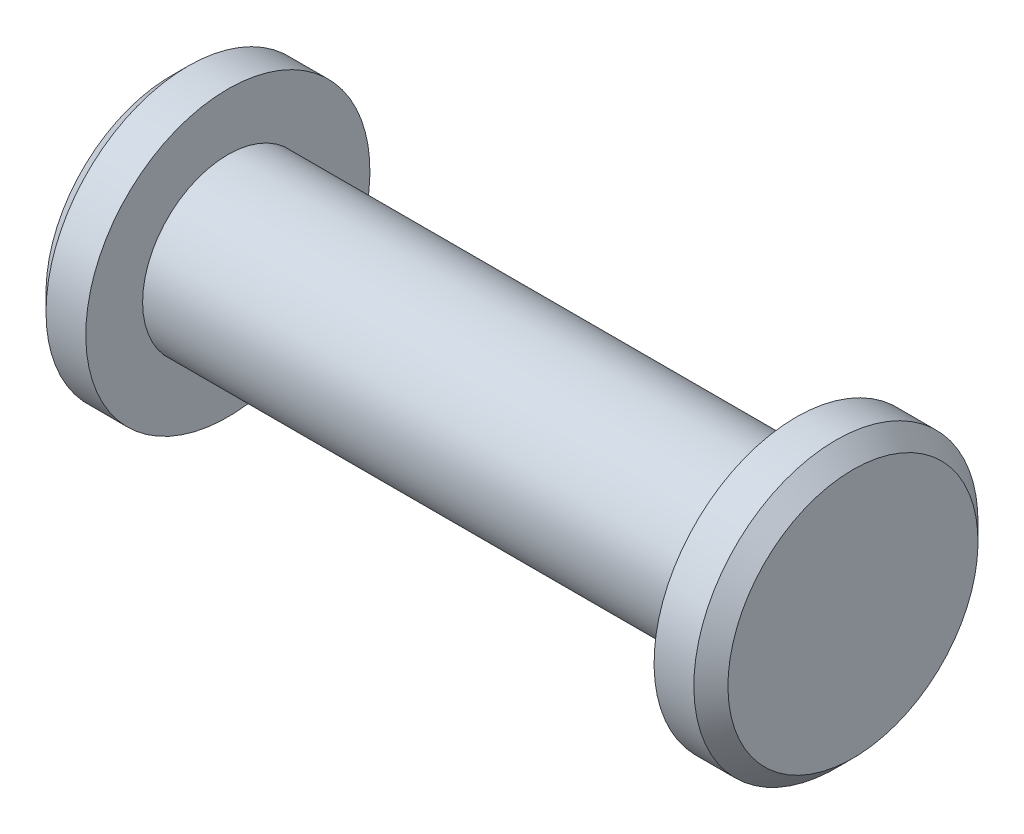
ISO-10303-21;
HEADER;
FILE_DESCRIPTION(('STEP AP214'),'2;1');
FILE_NAME('part.step','',(''),(''),'','','');
FILE_SCHEMA(('AUTOMOTIVE_DESIGN { 1 0 10303 214 1 1 1 1 }'));
ENDSEC;
DATA;
#1=APPLICATION_CONTEXT('core data for automotive mechanical design processes');
#2=APPLICATION_PROTOCOL_DEFINITION('international standard','automotive_design',2000,#1);
#3=PRODUCT_CONTEXT('',#1,'mechanical');
#4=PRODUCT('Part','Part','',(#3));
#5=PRODUCT_RELATED_PRODUCT_CATEGORY('part','',(#4));
#6=PRODUCT_DEFINITION_FORMATION('','',#4);
#7=PRODUCT_DEFINITION_CONTEXT('part definition',#1,'design');
#8=PRODUCT_DEFINITION('design','',#6,#7);
#9=PRODUCT_DEFINITION_SHAPE('','',#8);
#10=(LENGTH_UNIT() NAMED_UNIT(*) SI_UNIT(.MILLI.,.METRE.));
#11=(NAMED_UNIT(*) PLANE_ANGLE_UNIT() SI_UNIT($,.RADIAN.));
#12=(NAMED_UNIT(*) SI_UNIT($,.STERADIAN.) SOLID_ANGLE_UNIT());
#13=UNCERTAINTY_MEASURE_WITH_UNIT(LENGTH_MEASURE(1.E-05),#10,'distance_accuracy_value','');
#14=(GEOMETRIC_REPRESENTATION_CONTEXT(3) GLOBAL_UNCERTAINTY_ASSIGNED_CONTEXT((#13)) GLOBAL_UNIT_ASSIGNED_CONTEXT((#10,
#11,#12)) REPRESENTATION_CONTEXT('',''));
#15=CARTESIAN_POINT('',(0.,0.,0.));
#16=DIRECTION('',(0.,0.,1.));
#17=DIRECTION('',(1.,0.,0.));
#18=AXIS2_PLACEMENT_3D('',#15,#16,#17);
#19=CARTESIAN_POINT('',(0.,25.,0.));
#20=DIRECTION('',(1.,0.,0.));
#21=DIRECTION('',(0.,1.,0.));
#22=AXIS2_PLACEMENT_3D('',#19,#20,#21);
#23=PLANE('',#22);
#24=CARTESIAN_POINT('',(0.,0.,0.));
#25=DIRECTION('',(1.,0.,0.));
#26=DIRECTION('',(0.,1.,0.));
#27=AXIS2_PLACEMENT_3D('',#24,#25,#26);
#28=CIRCLE('',#27,22.0000000000001);
#29=CARTESIAN_POINT('',(0.,22.0000000000001,0.));
#30=VERTEX_POINT('',#29);
#31=EDGE_CURVE('E41',#30,#30,#28,.T.);
#32=ORIENTED_EDGE('',*,*,#31,.T.);
#33=EDGE_LOOP('',(#32));
#34=FACE_BOUND('',#33,.T.);
#35=ADVANCED_FACE('F33',(#34),#23,.T.);
#36=CARTESIAN_POINT('',(-120.,0.,0.));
#37=DIRECTION('',(-1.,0.,0.));
#38=DIRECTION('',(0.,-1.,0.));
#39=AXIS2_PLACEMENT_3D('',#36,#37,#38);
#40=PLANE('',#39);
#41=CARTESIAN_POINT('',(-120.,0.,0.));
#42=DIRECTION('',(-1.,0.,0.));
#43=DIRECTION('',(0.,-1.,0.));
#44=AXIS2_PLACEMENT_3D('',#41,#42,#43);
#45=CIRCLE('',#44,22.);
#46=CARTESIAN_POINT('',(-120.,-22.,0.));
#47=VERTEX_POINT('',#46);
#48=EDGE_CURVE('E45',#47,#47,#45,.T.);
#49=ORIENTED_EDGE('',*,*,#48,.T.);
#50=EDGE_LOOP('',(#49));
#51=FACE_BOUND('',#50,.T.);
#52=ADVANCED_FACE('F84',(#51),#40,.T.);
#53=CARTESIAN_POINT('',(0.,0.,0.));
#54=DIRECTION('',(1.,0.,0.));
#55=DIRECTION('',(0.,1.,0.));
#56=AXIS2_PLACEMENT_3D('',#53,#54,#55);
#57=CYLINDRICAL_SURFACE('',#56,25.);
#58=CARTESIAN_POINT('',(-117.,0.,0.));
#59=DIRECTION('',(-1.,0.,0.));
#60=DIRECTION('',(0.,-1.,0.));
#61=AXIS2_PLACEMENT_3D('',#58,#59,#60);
#62=CIRCLE('',#61,25.);
#63=CARTESIAN_POINT('',(-117.,-25.,0.));
#64=VERTEX_POINT('',#63);
#65=EDGE_CURVE('E49',#64,#64,#62,.F.);
#66=ORIENTED_EDGE('',*,*,#65,.T.);
#67=EDGE_LOOP('',(#66));
#68=FACE_BOUND('',#67,.T.);
#69=CARTESIAN_POINT('',(-110.,0.,0.));
#70=DIRECTION('',(1.,0.,0.));
#71=DIRECTION('',(0.,1.,0.));
#72=AXIS2_PLACEMENT_3D('',#69,#70,#71);
#73=CIRCLE('',#72,25.);
#74=CARTESIAN_POINT('',(-110.,25.,0.));
#75=VERTEX_POINT('',#74);
#76=EDGE_CURVE('E54',#75,#75,#73,.T.);
#77=ORIENTED_EDGE('',*,*,#76,.F.);
#78=EDGE_LOOP('',(#77));
#79=FACE_BOUND('',#78,.T.);
#80=ADVANCED_FACE('F89',(#68,#79),#57,.T.);
#81=CARTESIAN_POINT('',(-110.,25.,0.));
#82=DIRECTION('',(1.,0.,0.));
#83=DIRECTION('',(0.,1.,0.));
#84=AXIS2_PLACEMENT_3D('',#81,#82,#83);
#85=PLANE('',#84);
#86=ORIENTED_EDGE('',*,*,#76,.T.);
#87=EDGE_LOOP('',(#86));
#88=FACE_BOUND('',#87,.T.);
#89=CARTESIAN_POINT('',(-110.,0.,0.));
#90=DIRECTION('',(1.,0.,0.));
#91=DIRECTION('',(0.,1.,0.));
#92=AXIS2_PLACEMENT_3D('',#89,#90,#91);
#93=CIRCLE('',#92,15.);
#94=CARTESIAN_POINT('',(-110.,15.,0.));
#95=VERTEX_POINT('',#94);
#96=EDGE_CURVE('E57',#95,#95,#93,.T.);
#97=ORIENTED_EDGE('',*,*,#96,.F.);
#98=EDGE_LOOP('',(#97));
#99=FACE_BOUND('',#98,.T.);
#100=ADVANCED_FACE('F80',(#88,#99),#85,.T.);
#101=CARTESIAN_POINT('',(0.,0.,0.));
#102=DIRECTION('',(1.,0.,0.));
#103=DIRECTION('',(0.,1.,0.));
#104=AXIS2_PLACEMENT_3D('',#101,#102,#103);
#105=CYLINDRICAL_SURFACE('',#104,15.);
#106=ORIENTED_EDGE('',*,*,#96,.T.);
#107=EDGE_LOOP('',(#106));
#108=FACE_BOUND('',#107,.T.);
#109=CARTESIAN_POINT('',(-10.,0.,0.));
#110=DIRECTION('',(1.,0.,0.));
#111=DIRECTION('',(0.,1.,0.));
#112=AXIS2_PLACEMENT_3D('',#109,#110,#111);
#113=CIRCLE('',#112,15.);
#114=CARTESIAN_POINT('',(-10.,15.,0.));
#115=VERTEX_POINT('',#114);
#116=EDGE_CURVE('E60',#115,#115,#113,.T.);
#117=ORIENTED_EDGE('',*,*,#116,.F.);
#118=EDGE_LOOP('',(#117));
#119=FACE_BOUND('',#118,.T.);
#120=ADVANCED_FACE('F71',(#108,#119),#105,.T.);
#121=CARTESIAN_POINT('',(-10.,15.,0.));
#122=DIRECTION('',(-1.,0.,0.));
#123=DIRECTION('',(0.,-1.,0.));
#124=AXIS2_PLACEMENT_3D('',#121,#122,#123);
#125=PLANE('',#124);
#126=ORIENTED_EDGE('',*,*,#116,.T.);
#127=EDGE_LOOP('',(#126));
#128=FACE_BOUND('',#127,.T.);
#129=CARTESIAN_POINT('',(-9.99999999999999,0.,0.));
#130=DIRECTION('',(1.,0.,0.));
#131=DIRECTION('',(0.,1.,0.));
#132=AXIS2_PLACEMENT_3D('',#129,#130,#131);
#133=CIRCLE('',#132,25.);
#134=CARTESIAN_POINT('',(-10.,25.,0.));
#135=VERTEX_POINT('',#134);
#136=EDGE_CURVE('E63',#135,#135,#133,.T.);
#137=ORIENTED_EDGE('',*,*,#136,.F.);
#138=EDGE_LOOP('',(#137));
#139=FACE_BOUND('',#138,.T.);
#140=ADVANCED_FACE('F69',(#128,#139),#125,.T.);
#141=CARTESIAN_POINT('',(0.,0.,0.));
#142=DIRECTION('',(1.,0.,0.));
#143=DIRECTION('',(0.,1.,0.));
#144=AXIS2_PLACEMENT_3D('',#141,#142,#143);
#145=CYLINDRICAL_SURFACE('',#144,25.);
#146=CARTESIAN_POINT('',(-2.99999999999995,0.,0.));
#147=DIRECTION('',(1.,0.,0.));
#148=DIRECTION('',(0.,1.,0.));
#149=AXIS2_PLACEMENT_3D('',#146,#147,#148);
#150=CIRCLE('',#149,25.);
#151=CARTESIAN_POINT('',(-2.99999999999995,25.,0.));
#152=VERTEX_POINT('',#151);
#153=EDGE_CURVE('E10',#152,#152,#150,.F.);
#154=ORIENTED_EDGE('',*,*,#153,.T.);
#155=EDGE_LOOP('',(#154));
#156=FACE_BOUND('',#155,.T.);
#157=ORIENTED_EDGE('',*,*,#136,.T.);
#158=EDGE_LOOP('',(#157));
#159=FACE_BOUND('',#158,.T.);
#160=ADVANCED_FACE('F67',(#156,#159),#145,.T.);
#161=CARTESIAN_POINT('',(-117.,0.,0.));
#162=DIRECTION('',(1.,0.,0.));
#163=DIRECTION('',(0.,1.,0.));
#164=AXIS2_PLACEMENT_3D('',#161,#162,#163);
#165=CONICAL_SURFACE('',#164,25.,0.78539816339745);
#166=ORIENTED_EDGE('',*,*,#48,.F.);
#167=EDGE_LOOP('',(#166));
#168=FACE_BOUND('',#167,.T.);
#169=ORIENTED_EDGE('',*,*,#65,.F.);
#170=EDGE_LOOP('',(#169));
#171=FACE_BOUND('',#170,.T.);
#172=ADVANCED_FACE('F78',(#168,#171),#165,.T.);
#173=CARTESIAN_POINT('',(0.,0.,0.));
#174=DIRECTION('',(-1.,0.,0.));
#175=DIRECTION('',(0.,-1.,0.));
#176=AXIS2_PLACEMENT_3D('',#173,#174,#175);
#177=CONICAL_SURFACE('',#176,22.0000000000001,0.785398163397448);
#178=ORIENTED_EDGE('',*,*,#153,.F.);
#179=EDGE_LOOP('',(#178));
#180=FACE_BOUND('',#179,.T.);
#181=ORIENTED_EDGE('',*,*,#31,.F.);
#182=EDGE_LOOP('',(#181));
#183=FACE_BOUND('',#182,.T.);
#184=ADVANCED_FACE('F36',(#180,#183),#177,.T.);
#185=CLOSED_SHELL('',(#35,#52,#80,#100,#120,#140,#160,#172,#184));
#186=MANIFOLD_SOLID_BREP('B2',#185);
#187=ADVANCED_BREP_SHAPE_REPRESENTATION('',(#18,#186),#14);
#188=SHAPE_DEFINITION_REPRESENTATION(#9,#187);
ENDSEC;
END-ISO-10303-21;
